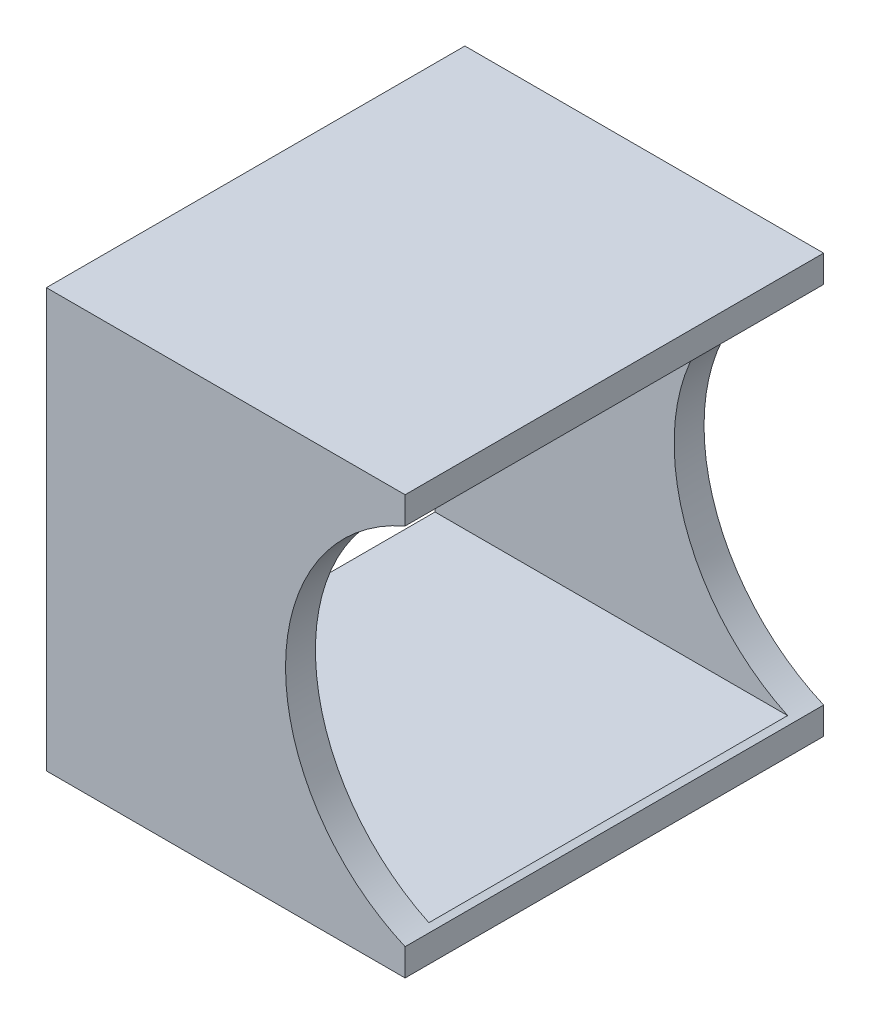
ISO-10303-21;
HEADER;
FILE_DESCRIPTION(('STEP AP214'),'2;1');
FILE_NAME('part.step','',(''),(''),'','','');
FILE_SCHEMA(('AUTOMOTIVE_DESIGN { 1 0 10303 214 1 1 1 1 }'));
ENDSEC;
DATA;
#1=APPLICATION_CONTEXT('core data for automotive mechanical design processes');
#2=APPLICATION_PROTOCOL_DEFINITION('international standard','automotive_design',2000,#1);
#3=PRODUCT_CONTEXT('',#1,'mechanical');
#4=PRODUCT('Part','Part','',(#3));
#5=PRODUCT_RELATED_PRODUCT_CATEGORY('part','',(#4));
#6=PRODUCT_DEFINITION_FORMATION('','',#4);
#7=PRODUCT_DEFINITION_CONTEXT('part definition',#1,'design');
#8=PRODUCT_DEFINITION('design','',#6,#7);
#9=PRODUCT_DEFINITION_SHAPE('','',#8);
#10=(LENGTH_UNIT() NAMED_UNIT(*) SI_UNIT(.MILLI.,.METRE.));
#11=(NAMED_UNIT(*) PLANE_ANGLE_UNIT() SI_UNIT($,.RADIAN.));
#12=(NAMED_UNIT(*) SI_UNIT($,.STERADIAN.) SOLID_ANGLE_UNIT());
#13=UNCERTAINTY_MEASURE_WITH_UNIT(LENGTH_MEASURE(1.E-05),#10,'distance_accuracy_value','');
#14=(GEOMETRIC_REPRESENTATION_CONTEXT(3) GLOBAL_UNCERTAINTY_ASSIGNED_CONTEXT((#13)) GLOBAL_UNIT_ASSIGNED_CONTEXT((#10,
#11,#12)) REPRESENTATION_CONTEXT('',''));
#15=CARTESIAN_POINT('',(0.,0.,0.));
#16=DIRECTION('',(0.,0.,1.));
#17=DIRECTION('',(1.,0.,0.));
#18=AXIS2_PLACEMENT_3D('',#15,#16,#17);
#19=CARTESIAN_POINT('',(38.1,0.,0.));
#20=DIRECTION('',(-1.,0.,0.));
#21=DIRECTION('',(0.,0.,1.));
#22=AXIS2_PLACEMENT_3D('',#19,#20,#21);
#23=PLANE('',#22);
#24=DIRECTION('',(0.,1.,0.));
#25=VECTOR('',#24,1.);
#26=CARTESIAN_POINT('',(38.1,0.,-44.45));
#27=LINE('',#26,#25);
#28=CARTESIAN_POINT('',(38.1,0.,-44.45));
#29=VERTEX_POINT('',#28);
#30=CARTESIAN_POINT('',(38.1,2.88093631110565,-44.45));
#31=VERTEX_POINT('',#30);
#32=EDGE_CURVE('E131',#29,#31,#27,.T.);
#33=ORIENTED_EDGE('',*,*,#32,.T.);
#34=DIRECTION('',(0.,0.,1.));
#35=VECTOR('',#34,1.);
#36=CARTESIAN_POINT('',(38.1,2.88093631110565,-44.45));
#37=LINE('',#36,#35);
#38=CARTESIAN_POINT('',(38.1,2.88093631110565,0.));
#39=VERTEX_POINT('',#38);
#40=EDGE_CURVE('E49',#31,#39,#37,.T.);
#41=ORIENTED_EDGE('',*,*,#40,.T.);
#42=DIRECTION('',(0.,-1.,0.));
#43=VECTOR('',#42,1.);
#44=CARTESIAN_POINT('',(38.1,0.,0.));
#45=LINE('',#44,#43);
#46=CARTESIAN_POINT('',(38.1,0.,0.));
#47=VERTEX_POINT('',#46);
#48=EDGE_CURVE('E150',#39,#47,#45,.T.);
#49=ORIENTED_EDGE('',*,*,#48,.T.);
#50=DIRECTION('',(0.,0.,-1.));
#51=VECTOR('',#50,1.);
#52=CARTESIAN_POINT('',(38.1,0.,0.));
#53=LINE('',#52,#51);
#54=EDGE_CURVE('E132',#47,#29,#53,.T.);
#55=ORIENTED_EDGE('',*,*,#54,.T.);
#56=EDGE_LOOP('',(#33,#41,#49,#55));
#57=FACE_BOUND('',#56,.T.);
#58=ADVANCED_FACE('F34',(#57),#23,.F.);
#59=CARTESIAN_POINT('',(38.1,44.45,0.));
#60=VERTEX_POINT('',#59);
#61=CARTESIAN_POINT('',(38.1,41.5690636888943,0.));
#62=VERTEX_POINT('',#61);
#63=EDGE_CURVE('E124',#60,#62,#45,.T.);
#64=ORIENTED_EDGE('',*,*,#63,.T.);
#65=DIRECTION('',(0.,0.,1.));
#66=VECTOR('',#65,1.);
#67=CARTESIAN_POINT('',(38.1,41.5690636888943,-44.45));
#68=LINE('',#67,#66);
#69=CARTESIAN_POINT('',(38.1,41.5690636888943,-44.45));
#70=VERTEX_POINT('',#69);
#71=EDGE_CURVE('E110',#62,#70,#68,.F.);
#72=ORIENTED_EDGE('',*,*,#71,.T.);
#73=CARTESIAN_POINT('',(38.1,44.45,-44.45));
#74=VERTEX_POINT('',#73);
#75=EDGE_CURVE('E121',#70,#74,#27,.T.);
#76=ORIENTED_EDGE('',*,*,#75,.T.);
#77=DIRECTION('',(0.,0.,1.));
#78=VECTOR('',#77,1.);
#79=CARTESIAN_POINT('',(38.1,44.45,0.));
#80=LINE('',#79,#78);
#81=EDGE_CURVE('E134',#74,#60,#80,.T.);
#82=ORIENTED_EDGE('',*,*,#81,.T.);
#83=EDGE_LOOP('',(#64,#72,#76,#82));
#84=FACE_BOUND('',#83,.T.);
#85=ADVANCED_FACE('F120',(#84),#23,.F.);
#86=CARTESIAN_POINT('',(0.,0.,0.));
#87=DIRECTION('',(-1.,0.,0.));
#88=DIRECTION('',(0.,0.,1.));
#89=AXIS2_PLACEMENT_3D('',#86,#87,#88);
#90=PLANE('',#89);
#91=DIRECTION('',(0.,-1.,0.));
#92=VECTOR('',#91,1.);
#93=CARTESIAN_POINT('',(0.,0.,0.));
#94=LINE('',#93,#92);
#95=CARTESIAN_POINT('',(0.,44.45,0.));
#96=VERTEX_POINT('',#95);
#97=CARTESIAN_POINT('',(0.,0.,0.));
#98=VERTEX_POINT('',#97);
#99=EDGE_CURVE('E140',#96,#98,#94,.T.);
#100=ORIENTED_EDGE('',*,*,#99,.F.);
#101=DIRECTION('',(0.,0.,1.));
#102=VECTOR('',#101,1.);
#103=CARTESIAN_POINT('',(0.,44.45,0.));
#104=LINE('',#103,#102);
#105=CARTESIAN_POINT('',(0.,44.45,-44.45));
#106=VERTEX_POINT('',#105);
#107=EDGE_CURVE('E148',#106,#96,#104,.T.);
#108=ORIENTED_EDGE('',*,*,#107,.F.);
#109=DIRECTION('',(0.,1.,0.));
#110=VECTOR('',#109,1.);
#111=CARTESIAN_POINT('',(0.,0.,-44.45));
#112=LINE('',#111,#110);
#113=CARTESIAN_POINT('',(0.,0.,-44.45));
#114=VERTEX_POINT('',#113);
#115=EDGE_CURVE('E146',#114,#106,#112,.T.);
#116=ORIENTED_EDGE('',*,*,#115,.F.);
#117=DIRECTION('',(0.,0.,-1.));
#118=VECTOR('',#117,1.);
#119=CARTESIAN_POINT('',(0.,0.,0.));
#120=LINE('',#119,#118);
#121=EDGE_CURVE('E143',#98,#114,#120,.T.);
#122=ORIENTED_EDGE('',*,*,#121,.F.);
#123=EDGE_LOOP('',(#100,#108,#116,#122));
#124=FACE_BOUND('',#123,.T.);
#125=DIRECTION('',(0.,0.,1.));
#126=VECTOR('',#125,1.);
#127=CARTESIAN_POINT('',(0.,41.275,-3.175));
#128=LINE('',#127,#126);
#129=CARTESIAN_POINT('',(0.,41.275,-41.275));
#130=VERTEX_POINT('',#129);
#131=CARTESIAN_POINT('',(0.,41.275,-3.175));
#132=VERTEX_POINT('',#131);
#133=EDGE_CURVE('E181',#130,#132,#128,.T.);
#134=ORIENTED_EDGE('',*,*,#133,.T.);
#135=DIRECTION('',(0.,-1.,0.));
#136=VECTOR('',#135,1.);
#137=CARTESIAN_POINT('',(0.,41.275,-3.175));
#138=LINE('',#137,#136);
#139=CARTESIAN_POINT('',(0.,3.175,-3.175));
#140=VERTEX_POINT('',#139);
#141=EDGE_CURVE('E190',#132,#140,#138,.T.);
#142=ORIENTED_EDGE('',*,*,#141,.T.);
#143=DIRECTION('',(0.,0.,-1.));
#144=VECTOR('',#143,1.);
#145=CARTESIAN_POINT('',(0.,3.175,-3.175));
#146=LINE('',#145,#144);
#147=CARTESIAN_POINT('',(0.,3.175,-41.275));
#148=VERTEX_POINT('',#147);
#149=EDGE_CURVE('E187',#140,#148,#146,.T.);
#150=ORIENTED_EDGE('',*,*,#149,.T.);
#151=DIRECTION('',(0.,1.,0.));
#152=VECTOR('',#151,1.);
#153=CARTESIAN_POINT('',(0.,41.275,-41.275));
#154=LINE('',#153,#152);
#155=EDGE_CURVE('E184',#148,#130,#154,.T.);
#156=ORIENTED_EDGE('',*,*,#155,.T.);
#157=EDGE_LOOP('',(#134,#142,#150,#156));
#158=FACE_BOUND('',#157,.T.);
#159=ADVANCED_FACE('F168',(#124,#158),#90,.T.);
#160=CARTESIAN_POINT('',(38.1,0.,0.));
#161=DIRECTION('',(0.,0.,-1.));
#162=DIRECTION('',(-1.,0.,0.));
#163=AXIS2_PLACEMENT_3D('',#160,#161,#162);
#164=PLANE('',#163);
#165=ORIENTED_EDGE('',*,*,#48,.F.);
#166=CARTESIAN_POINT('',(46.482,22.225,0.));
#167=DIRECTION('',(0.,0.,-1.));
#168=DIRECTION('',(-1.,0.,0.));
#169=AXIS2_PLACEMENT_3D('',#166,#167,#168);
#170=CIRCLE('',#169,21.082);
#171=EDGE_CURVE('E125',#39,#62,#170,.T.);
#172=ORIENTED_EDGE('',*,*,#171,.T.);
#173=ORIENTED_EDGE('',*,*,#63,.F.);
#174=DIRECTION('',(-1.,0.,0.));
#175=VECTOR('',#174,1.);
#176=CARTESIAN_POINT('',(38.1,44.45,0.));
#177=LINE('',#176,#175);
#178=EDGE_CURVE('E139',#60,#96,#177,.T.);
#179=ORIENTED_EDGE('',*,*,#178,.T.);
#180=ORIENTED_EDGE('',*,*,#99,.T.);
#181=DIRECTION('',(-1.,0.,0.));
#182=VECTOR('',#181,1.);
#183=CARTESIAN_POINT('',(38.1,0.,0.));
#184=LINE('',#183,#182);
#185=EDGE_CURVE('E42',#47,#98,#184,.T.);
#186=ORIENTED_EDGE('',*,*,#185,.F.);
#187=EDGE_LOOP('',(#165,#172,#173,#179,#180,#186));
#188=FACE_BOUND('',#187,.T.);
#189=ADVANCED_FACE('F36',(#188),#164,.F.);
#190=CARTESIAN_POINT('',(38.1,0.,0.));
#191=DIRECTION('',(0.,1.,0.));
#192=DIRECTION('',(0.,0.,1.));
#193=AXIS2_PLACEMENT_3D('',#190,#191,#192);
#194=PLANE('',#193);
#195=ORIENTED_EDGE('',*,*,#121,.T.);
#196=DIRECTION('',(-1.,0.,0.));
#197=VECTOR('',#196,1.);
#198=CARTESIAN_POINT('',(38.1,0.,-44.45));
#199=LINE('',#198,#197);
#200=EDGE_CURVE('E154',#29,#114,#199,.T.);
#201=ORIENTED_EDGE('',*,*,#200,.F.);
#202=ORIENTED_EDGE('',*,*,#54,.F.);
#203=ORIENTED_EDGE('',*,*,#185,.T.);
#204=EDGE_LOOP('',(#195,#201,#202,#203));
#205=FACE_BOUND('',#204,.T.);
#206=ADVANCED_FACE('F160',(#205),#194,.F.);
#207=CARTESIAN_POINT('',(38.1,0.,-44.45));
#208=DIRECTION('',(0.,0.,1.));
#209=DIRECTION('',(1.,0.,0.));
#210=AXIS2_PLACEMENT_3D('',#207,#208,#209);
#211=PLANE('',#210);
#212=ORIENTED_EDGE('',*,*,#75,.F.);
#213=CARTESIAN_POINT('',(46.482,22.225,-44.45));
#214=DIRECTION('',(0.,0.,1.));
#215=DIRECTION('',(1.,0.,0.));
#216=AXIS2_PLACEMENT_3D('',#213,#214,#215);
#217=CIRCLE('',#216,21.082);
#218=EDGE_CURVE('E107',#70,#31,#217,.T.);
#219=ORIENTED_EDGE('',*,*,#218,.T.);
#220=ORIENTED_EDGE('',*,*,#32,.F.);
#221=ORIENTED_EDGE('',*,*,#200,.T.);
#222=ORIENTED_EDGE('',*,*,#115,.T.);
#223=DIRECTION('',(-1.,0.,0.));
#224=VECTOR('',#223,1.);
#225=CARTESIAN_POINT('',(38.1,44.45,-44.45));
#226=LINE('',#225,#224);
#227=EDGE_CURVE('E129',#74,#106,#226,.T.);
#228=ORIENTED_EDGE('',*,*,#227,.F.);
#229=EDGE_LOOP('',(#212,#219,#220,#221,#222,#228));
#230=FACE_BOUND('',#229,.T.);
#231=ADVANCED_FACE('F127',(#230),#211,.F.);
#232=CARTESIAN_POINT('',(38.1,44.45,0.));
#233=DIRECTION('',(0.,-1.,0.));
#234=DIRECTION('',(0.,0.,-1.));
#235=AXIS2_PLACEMENT_3D('',#232,#233,#234);
#236=PLANE('',#235);
#237=ORIENTED_EDGE('',*,*,#107,.T.);
#238=ORIENTED_EDGE('',*,*,#178,.F.);
#239=ORIENTED_EDGE('',*,*,#81,.F.);
#240=ORIENTED_EDGE('',*,*,#227,.T.);
#241=EDGE_LOOP('',(#237,#238,#239,#240));
#242=FACE_BOUND('',#241,.T.);
#243=ADVANCED_FACE('F172',(#242),#236,.F.);
#244=CARTESIAN_POINT('',(38.1,41.275,-3.175));
#245=DIRECTION('',(0.,0.,-1.));
#246=DIRECTION('',(0.,1.,0.));
#247=AXIS2_PLACEMENT_3D('',#244,#245,#246);
#248=PLANE('',#247);
#249=CARTESIAN_POINT('',(46.482,22.225,-3.175));
#250=DIRECTION('',(0.,0.,-1.));
#251=DIRECTION('',(0.,1.,0.));
#252=AXIS2_PLACEMENT_3D('',#249,#250,#251);
#253=CIRCLE('',#252,21.082);
#254=CARTESIAN_POINT('',(37.4515944720073,3.175,-3.175));
#255=VERTEX_POINT('',#254);
#256=CARTESIAN_POINT('',(37.4515944720073,41.275,-3.175));
#257=VERTEX_POINT('',#256);
#258=EDGE_CURVE('E56',#255,#257,#253,.T.);
#259=ORIENTED_EDGE('',*,*,#258,.F.);
#260=DIRECTION('',(-1.,0.,0.));
#261=VECTOR('',#260,1.);
#262=CARTESIAN_POINT('',(38.1,3.175,-3.175));
#263=LINE('',#262,#261);
#264=EDGE_CURVE('E144',#255,#140,#263,.T.);
#265=ORIENTED_EDGE('',*,*,#264,.T.);
#266=ORIENTED_EDGE('',*,*,#141,.F.);
#267=DIRECTION('',(-1.,0.,0.));
#268=VECTOR('',#267,1.);
#269=CARTESIAN_POINT('',(38.1,41.275,-3.175));
#270=LINE('',#269,#268);
#271=EDGE_CURVE('E179',#257,#132,#270,.T.);
#272=ORIENTED_EDGE('',*,*,#271,.F.);
#273=EDGE_LOOP('',(#259,#265,#266,#272));
#274=FACE_BOUND('',#273,.T.);
#275=ADVANCED_FACE('F213',(#274),#248,.T.);
#276=CARTESIAN_POINT('',(38.1,3.175,-3.175));
#277=DIRECTION('',(0.,1.,0.));
#278=DIRECTION('',(0.,0.,1.));
#279=AXIS2_PLACEMENT_3D('',#276,#277,#278);
#280=PLANE('',#279);
#281=DIRECTION('',(0.,0.,1.));
#282=VECTOR('',#281,1.);
#283=CARTESIAN_POINT('',(37.4515944720073,3.175,-44.45));
#284=LINE('',#283,#282);
#285=CARTESIAN_POINT('',(37.4515944720073,3.175,-41.275));
#286=VERTEX_POINT('',#285);
#287=EDGE_CURVE('E196',#286,#255,#284,.T.);
#288=ORIENTED_EDGE('',*,*,#287,.F.);
#289=DIRECTION('',(-1.,0.,0.));
#290=VECTOR('',#289,1.);
#291=CARTESIAN_POINT('',(38.1,3.175,-41.275));
#292=LINE('',#291,#290);
#293=EDGE_CURVE('E175',#286,#148,#292,.T.);
#294=ORIENTED_EDGE('',*,*,#293,.T.);
#295=ORIENTED_EDGE('',*,*,#149,.F.);
#296=ORIENTED_EDGE('',*,*,#264,.F.);
#297=EDGE_LOOP('',(#288,#294,#295,#296));
#298=FACE_BOUND('',#297,.T.);
#299=ADVANCED_FACE('F205',(#298),#280,.T.);
#300=CARTESIAN_POINT('',(38.1,41.275,-41.275));
#301=DIRECTION('',(0.,0.,1.));
#302=DIRECTION('',(1.,0.,0.));
#303=AXIS2_PLACEMENT_3D('',#300,#301,#302);
#304=PLANE('',#303);
#305=CARTESIAN_POINT('',(46.482,22.225,-41.275));
#306=DIRECTION('',(0.,0.,1.));
#307=DIRECTION('',(1.,0.,0.));
#308=AXIS2_PLACEMENT_3D('',#305,#306,#307);
#309=CIRCLE('',#308,21.082);
#310=CARTESIAN_POINT('',(37.4515944720073,41.275,-41.275));
#311=VERTEX_POINT('',#310);
#312=EDGE_CURVE('E116',#311,#286,#309,.T.);
#313=ORIENTED_EDGE('',*,*,#312,.F.);
#314=DIRECTION('',(-1.,0.,0.));
#315=VECTOR('',#314,1.);
#316=CARTESIAN_POINT('',(38.1,41.275,-41.275));
#317=LINE('',#316,#315);
#318=EDGE_CURVE('E177',#311,#130,#317,.T.);
#319=ORIENTED_EDGE('',*,*,#318,.T.);
#320=ORIENTED_EDGE('',*,*,#155,.F.);
#321=ORIENTED_EDGE('',*,*,#293,.F.);
#322=EDGE_LOOP('',(#313,#319,#320,#321));
#323=FACE_BOUND('',#322,.T.);
#324=ADVANCED_FACE('F208',(#323),#304,.T.);
#325=CARTESIAN_POINT('',(38.1,41.275,-3.175));
#326=DIRECTION('',(0.,-1.,0.));
#327=DIRECTION('',(0.,0.,-1.));
#328=AXIS2_PLACEMENT_3D('',#325,#326,#327);
#329=PLANE('',#328);
#330=DIRECTION('',(0.,0.,1.));
#331=VECTOR('',#330,1.);
#332=CARTESIAN_POINT('',(37.4515944720073,41.275,-44.45));
#333=LINE('',#332,#331);
#334=EDGE_CURVE('E11',#257,#311,#333,.F.);
#335=ORIENTED_EDGE('',*,*,#334,.F.);
#336=ORIENTED_EDGE('',*,*,#271,.T.);
#337=ORIENTED_EDGE('',*,*,#133,.F.);
#338=ORIENTED_EDGE('',*,*,#318,.F.);
#339=EDGE_LOOP('',(#335,#336,#337,#338));
#340=FACE_BOUND('',#339,.T.);
#341=ADVANCED_FACE('F215',(#340),#329,.T.);
#342=CARTESIAN_POINT('',(46.482,22.225,-44.45));
#343=DIRECTION('',(0.,0.,1.));
#344=DIRECTION('',(1.,0.,0.));
#345=AXIS2_PLACEMENT_3D('',#342,#343,#344);
#346=CYLINDRICAL_SURFACE('',#345,21.082);
#347=ORIENTED_EDGE('',*,*,#258,.T.);
#348=ORIENTED_EDGE('',*,*,#334,.T.);
#349=ORIENTED_EDGE('',*,*,#312,.T.);
#350=ORIENTED_EDGE('',*,*,#287,.T.);
#351=EDGE_LOOP('',(#347,#348,#349,#350));
#352=FACE_BOUND('',#351,.T.);
#353=ORIENTED_EDGE('',*,*,#218,.F.);
#354=ORIENTED_EDGE('',*,*,#71,.F.);
#355=ORIENTED_EDGE('',*,*,#171,.F.);
#356=ORIENTED_EDGE('',*,*,#40,.F.);
#357=EDGE_LOOP('',(#353,#354,#355,#356));
#358=FACE_BOUND('',#357,.T.);
#359=ADVANCED_FACE('F109',(#352,#358),#346,.F.);
#360=CLOSED_SHELL('',(#58,#85,#159,#189,#206,#231,#243,#275,#299,#324,#341,#359));
#361=MANIFOLD_SOLID_BREP('B2',#360);
#362=ADVANCED_BREP_SHAPE_REPRESENTATION('',(#18,#361),#14);
#363=SHAPE_DEFINITION_REPRESENTATION(#9,#362);
ENDSEC;
END-ISO-10303-21;
